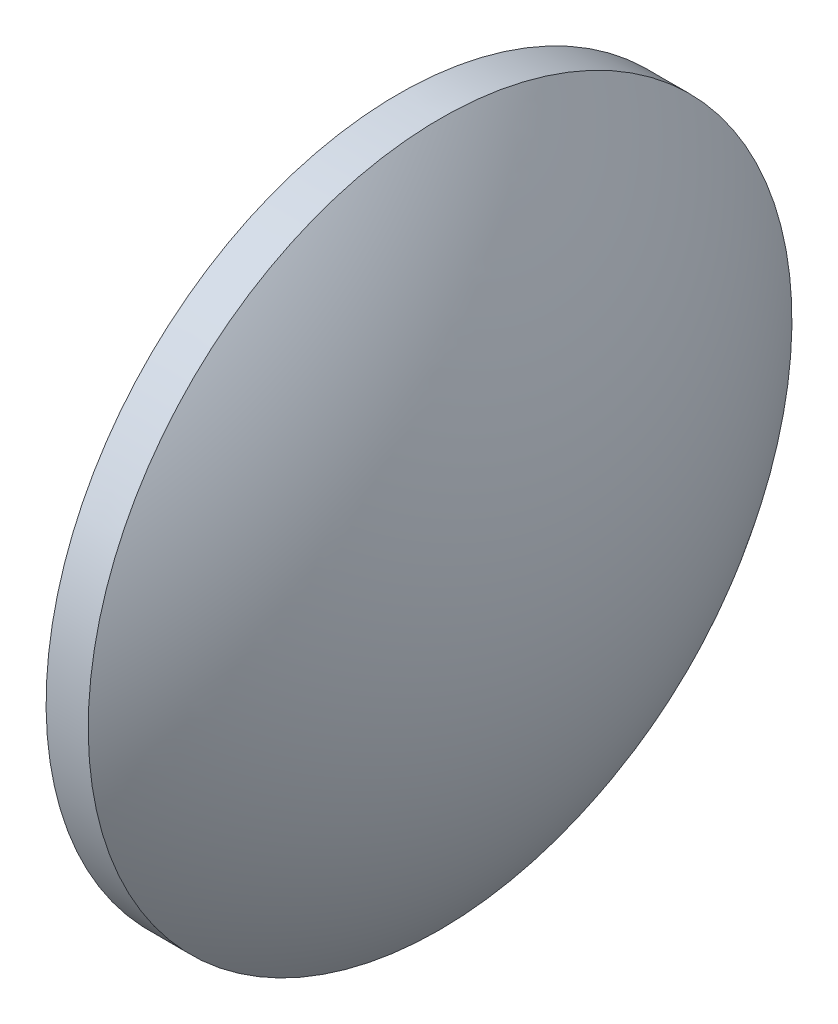
ISO-10303-21;
HEADER;
FILE_DESCRIPTION(('STEP AP214'),'2;1');
FILE_NAME('part.step','',(''),(''),'','','');
FILE_SCHEMA(('AUTOMOTIVE_DESIGN { 1 0 10303 214 1 1 1 1 }'));
ENDSEC;
DATA;
#1=APPLICATION_CONTEXT('core data for automotive mechanical design processes');
#2=APPLICATION_PROTOCOL_DEFINITION('international standard','automotive_design',2000,#1);
#3=PRODUCT_CONTEXT('',#1,'mechanical');
#4=PRODUCT('Part','Part','',(#3));
#5=PRODUCT_RELATED_PRODUCT_CATEGORY('part','',(#4));
#6=PRODUCT_DEFINITION_FORMATION('','',#4);
#7=PRODUCT_DEFINITION_CONTEXT('part definition',#1,'design');
#8=PRODUCT_DEFINITION('design','',#6,#7);
#9=PRODUCT_DEFINITION_SHAPE('','',#8);
#10=(LENGTH_UNIT() NAMED_UNIT(*) SI_UNIT(.MILLI.,.METRE.));
#11=(NAMED_UNIT(*) PLANE_ANGLE_UNIT() SI_UNIT($,.RADIAN.));
#12=(NAMED_UNIT(*) SI_UNIT($,.STERADIAN.) SOLID_ANGLE_UNIT());
#13=UNCERTAINTY_MEASURE_WITH_UNIT(LENGTH_MEASURE(1.E-05),#10,'distance_accuracy_value','');
#14=(GEOMETRIC_REPRESENTATION_CONTEXT(3) GLOBAL_UNCERTAINTY_ASSIGNED_CONTEXT((#13)) GLOBAL_UNIT_ASSIGNED_CONTEXT((#10,
#11,#12)) REPRESENTATION_CONTEXT('',''));
#15=CARTESIAN_POINT('',(0.,0.,0.));
#16=DIRECTION('',(0.,0.,1.));
#17=DIRECTION('',(1.,0.,0.));
#18=AXIS2_PLACEMENT_3D('',#15,#16,#17);
#19=CARTESIAN_POINT('',(439.478782873715,47.0563444474083,0.));
#20=DIRECTION('',(0.,0.,-1.));
#21=DIRECTION('',(-0.00194244466169369,-0.999998113452589,0.));
#22=AXIS2_PLACEMENT_3D('',#19,#20,#21);
#23=CIRCLE('',#22,41.2849881376037);
#24=TRIMMED_CURVE('',#23,(PARAMETER_VALUE(-1.56939165928694)),
(PARAMETER_VALUE(1.56939165928694)),.T.,.PARAMETER.);
#25=CARTESIAN_POINT('',(439.47867022812,46.9983528944795,0.));
#26=DIRECTION('',(-0.999998113452589,0.00194244466169369,0.));
#27=AXIS1_PLACEMENT('',#25,#26);
#28=SURFACE_OF_REVOLUTION('',#24,#27);
#29=CARTESIAN_POINT('',(472.284973375925,46.9346283458407,0.));
#30=DIRECTION('',(-0.999998113452589,0.00194244466169369,0.));
#31=DIRECTION('',(-0.00194244466169369,-0.999998113452589,0.));
#32=AXIS2_PLACEMENT_3D('',#29,#30,#31);
#33=CIRCLE('',#32,25.0057801702998);
#34=CARTESIAN_POINT('',(472.236401031722,21.9288953501308,0.));
#35=VERTEX_POINT('',#34);
#36=EDGE_CURVE('E11',#35,#35,#33,.T.);
#37=ORIENTED_EDGE('',*,*,#36,.F.);
#38=EDGE_LOOP('',(#37));
#39=FACE_BOUND('',#38,.T.);
#40=CARTESIAN_POINT('',(480.763539750204,46.9181591687783,0.));
#41=VERTEX_POINT('',#40);
#42=VERTEX_LOOP('',#41);
#43=FACE_BOUND('',#42,.T.);
#44=ADVANCED_FACE('F37',(#39,#43),#28,.T.);
#45=CARTESIAN_POINT('',(472.284973375925,46.9346283458407,0.));
#46=DIRECTION('',(0.999998113452589,-0.00194244466169369,0.));
#47=DIRECTION('',(0.00194244466169369,0.999998113452589,0.));
#48=AXIS2_PLACEMENT_3D('',#45,#46,#47);
#49=CONICAL_SURFACE('',#48,25.0057801702998,0.0019424458831986);
#50=CARTESIAN_POINT('',(469.284984695199,46.9404556688323,0.));
#51=DIRECTION('',(-0.999998113452589,0.00194244466169369,0.));
#52=DIRECTION('',(-0.00194244466169369,-0.999998113452589,0.));
#53=AXIS2_PLACEMENT_3D('',#50,#51,#52);
#54=CIRCLE('',#53,24.9999528363147);
#55=CARTESIAN_POINT('',(469.23642367027,21.9405499961139,0.));
#56=VERTEX_POINT('',#55);
#57=EDGE_CURVE('E44',#56,#56,#54,.T.);
#58=ORIENTED_EDGE('',*,*,#57,.F.);
#59=EDGE_LOOP('',(#58));
#60=FACE_BOUND('',#59,.T.);
#61=ORIENTED_EDGE('',*,*,#36,.T.);
#62=EDGE_LOOP('',(#61));
#63=FACE_BOUND('',#62,.T.);
#64=ADVANCED_FACE('F53',(#60,#63),#49,.T.);
#65=CARTESIAN_POINT('',(469.284984695199,46.9404556688323,0.));
#66=DIRECTION('',(-0.999998113452589,0.00194244466169369,0.));
#67=DIRECTION('',(-0.00194244466169369,-0.999998113452589,0.));
#68=AXIS2_PLACEMENT_3D('',#65,#66,#67);
#69=CONICAL_SURFACE('',#68,24.9999528363147,1.5688538809117);
#70=CARTESIAN_POINT('',(469.333545720129,46.9403613415507,0.));
#71=VERTEX_POINT('',#70);
#72=VERTEX_LOOP('',#71);
#73=FACE_BOUND('',#72,.T.);
#74=ORIENTED_EDGE('',*,*,#57,.T.);
#75=EDGE_LOOP('',(#74));
#76=FACE_BOUND('',#75,.T.);
#77=ADVANCED_FACE('F50',(#73,#76),#69,.F.);
#78=CLOSED_SHELL('',(#44,#64,#77));
#79=MANIFOLD_SOLID_BREP('B2',#78);
#80=ADVANCED_BREP_SHAPE_REPRESENTATION('',(#18,#79),#14);
#81=SHAPE_DEFINITION_REPRESENTATION(#9,#80);
ENDSEC;
END-ISO-10303-21;
